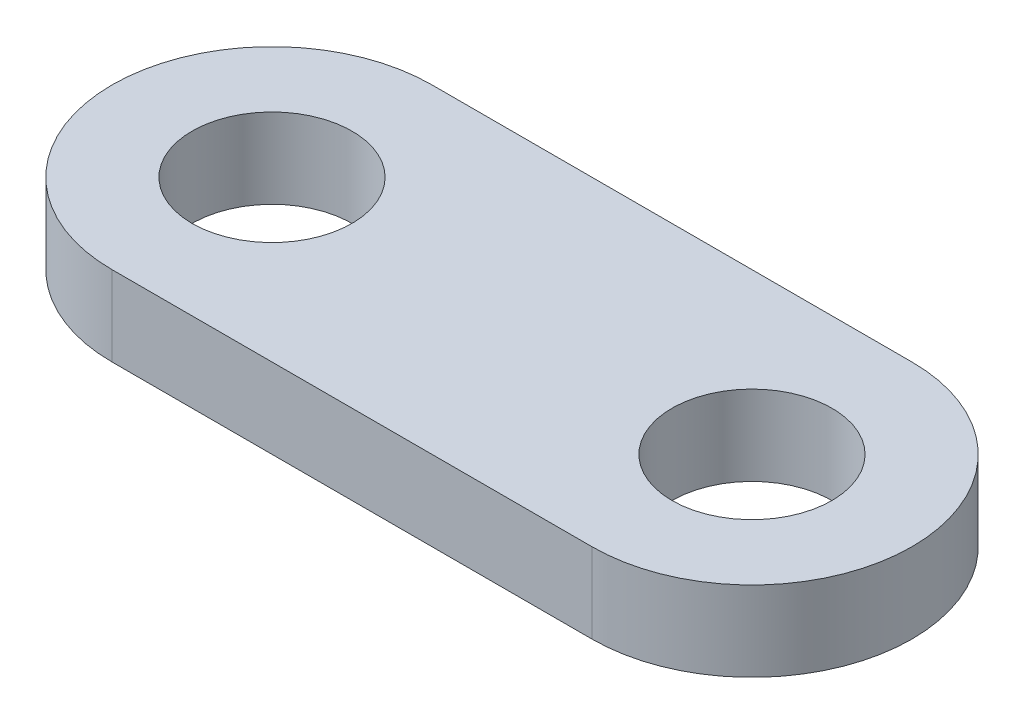
ISO-10303-21;
HEADER;
FILE_DESCRIPTION(('STEP AP214'),'2;1');
FILE_NAME('part.step','',(''),(''),'','','');
FILE_SCHEMA(('AUTOMOTIVE_DESIGN { 1 0 10303 214 1 1 1 1 }'));
ENDSEC;
DATA;
#1=APPLICATION_CONTEXT('core data for automotive mechanical design processes');
#2=APPLICATION_PROTOCOL_DEFINITION('international standard','automotive_design',2000,#1);
#3=PRODUCT_CONTEXT('',#1,'mechanical');
#4=PRODUCT('Part','Part','',(#3));
#5=PRODUCT_RELATED_PRODUCT_CATEGORY('part','',(#4));
#6=PRODUCT_DEFINITION_FORMATION('','',#4);
#7=PRODUCT_DEFINITION_CONTEXT('part definition',#1,'design');
#8=PRODUCT_DEFINITION('design','',#6,#7);
#9=PRODUCT_DEFINITION_SHAPE('','',#8);
#10=(LENGTH_UNIT() NAMED_UNIT(*) SI_UNIT(.MILLI.,.METRE.));
#11=(NAMED_UNIT(*) PLANE_ANGLE_UNIT() SI_UNIT($,.RADIAN.));
#12=(NAMED_UNIT(*) SI_UNIT($,.STERADIAN.) SOLID_ANGLE_UNIT());
#13=UNCERTAINTY_MEASURE_WITH_UNIT(LENGTH_MEASURE(1.E-05),#10,'distance_accuracy_value','');
#14=(GEOMETRIC_REPRESENTATION_CONTEXT(3) GLOBAL_UNCERTAINTY_ASSIGNED_CONTEXT((#13)) GLOBAL_UNIT_ASSIGNED_CONTEXT((#10,
#11,#12)) REPRESENTATION_CONTEXT('',''));
#15=CARTESIAN_POINT('',(0.,0.,0.));
#16=DIRECTION('',(0.,0.,1.));
#17=DIRECTION('',(1.,0.,0.));
#18=AXIS2_PLACEMENT_3D('',#15,#16,#17);
#19=CARTESIAN_POINT('',(0.,5.,0.));
#20=DIRECTION('',(0.,1.,0.));
#21=DIRECTION('',(0.,0.,1.));
#22=AXIS2_PLACEMENT_3D('',#19,#20,#21);
#23=PLANE('',#22);
#24=CARTESIAN_POINT('',(0.,5.,0.));
#25=DIRECTION('',(0.,1.,0.));
#26=DIRECTION('',(0.,0.,1.));
#27=AXIS2_PLACEMENT_3D('',#24,#25,#26);
#28=CIRCLE('',#27,5.);
#29=CARTESIAN_POINT('',(0.,5.,5.));
#30=VERTEX_POINT('',#29);
#31=EDGE_CURVE('E115',#30,#30,#28,.T.);
#32=ORIENTED_EDGE('',*,*,#31,.F.);
#33=EDGE_LOOP('',(#32));
#34=FACE_BOUND('',#33,.T.);
#35=CARTESIAN_POINT('',(0.,5.,0.));
#36=DIRECTION('',(0.,1.,0.));
#37=DIRECTION('',(0.,0.,1.));
#38=AXIS2_PLACEMENT_3D('',#35,#36,#37);
#39=CIRCLE('',#38,10.);
#40=CARTESIAN_POINT('',(0.,5.,-9.99999999999999));
#41=VERTEX_POINT('',#40);
#42=CARTESIAN_POINT('',(0.,5.,9.99999999999999));
#43=VERTEX_POINT('',#42);
#44=EDGE_CURVE('E93',#41,#43,#39,.T.);
#45=ORIENTED_EDGE('',*,*,#44,.T.);
#46=DIRECTION('',(1.,0.,0.));
#47=VECTOR('',#46,1.);
#48=CARTESIAN_POINT('',(0.,5.,9.99999999999999));
#49=LINE('',#48,#47);
#50=CARTESIAN_POINT('',(30.,5.,9.99999999999999));
#51=VERTEX_POINT('',#50);
#52=EDGE_CURVE('E88',#43,#51,#49,.T.);
#53=ORIENTED_EDGE('',*,*,#52,.T.);
#54=CARTESIAN_POINT('',(30.,5.,0.));
#55=DIRECTION('',(0.,1.,0.));
#56=DIRECTION('',(0.,0.,1.));
#57=AXIS2_PLACEMENT_3D('',#54,#55,#56);
#58=CIRCLE('',#57,10.);
#59=CARTESIAN_POINT('',(30.,5.,-9.99999999999999));
#60=VERTEX_POINT('',#59);
#61=EDGE_CURVE('E91',#51,#60,#58,.T.);
#62=ORIENTED_EDGE('',*,*,#61,.T.);
#63=DIRECTION('',(-1.,0.,0.));
#64=VECTOR('',#63,1.);
#65=CARTESIAN_POINT('',(0.,5.,-9.99999999999999));
#66=LINE('',#65,#64);
#67=EDGE_CURVE('E58',#60,#41,#66,.T.);
#68=ORIENTED_EDGE('',*,*,#67,.T.);
#69=EDGE_LOOP('',(#45,#53,#62,#68));
#70=FACE_BOUND('',#69,.T.);
#71=CARTESIAN_POINT('',(30.,5.,0.));
#72=DIRECTION('',(0.,1.,0.));
#73=DIRECTION('',(0.,0.,1.));
#74=AXIS2_PLACEMENT_3D('',#71,#72,#73);
#75=CIRCLE('',#74,5.);
#76=CARTESIAN_POINT('',(30.,5.,5.));
#77=VERTEX_POINT('',#76);
#78=EDGE_CURVE('E141',#77,#77,#75,.T.);
#79=ORIENTED_EDGE('',*,*,#78,.F.);
#80=EDGE_LOOP('',(#79));
#81=FACE_BOUND('',#80,.T.);
#82=ADVANCED_FACE('F40',(#34,#70,#81),#23,.T.);
#83=CARTESIAN_POINT('',(0.,0.,0.));
#84=DIRECTION('',(0.,1.,0.));
#85=DIRECTION('',(0.,0.,1.));
#86=AXIS2_PLACEMENT_3D('',#83,#84,#85);
#87=PLANE('',#86);
#88=CARTESIAN_POINT('',(0.,0.,0.));
#89=DIRECTION('',(0.,1.,0.));
#90=DIRECTION('',(0.,0.,1.));
#91=AXIS2_PLACEMENT_3D('',#88,#89,#90);
#92=CIRCLE('',#91,10.);
#93=CARTESIAN_POINT('',(0.,0.,-9.99999999999999));
#94=VERTEX_POINT('',#93);
#95=CARTESIAN_POINT('',(0.,0.,9.99999999999999));
#96=VERTEX_POINT('',#95);
#97=EDGE_CURVE('E111',#94,#96,#92,.T.);
#98=ORIENTED_EDGE('',*,*,#97,.F.);
#99=DIRECTION('',(-1.,0.,0.));
#100=VECTOR('',#99,1.);
#101=CARTESIAN_POINT('',(0.,0.,-9.99999999999999));
#102=LINE('',#101,#100);
#103=CARTESIAN_POINT('',(30.,0.,-9.99999999999999));
#104=VERTEX_POINT('',#103);
#105=EDGE_CURVE('E81',#104,#94,#102,.T.);
#106=ORIENTED_EDGE('',*,*,#105,.F.);
#107=CARTESIAN_POINT('',(30.,0.,0.));
#108=DIRECTION('',(0.,1.,0.));
#109=DIRECTION('',(0.,0.,1.));
#110=AXIS2_PLACEMENT_3D('',#107,#108,#109);
#111=CIRCLE('',#110,10.);
#112=CARTESIAN_POINT('',(30.,0.,9.99999999999999));
#113=VERTEX_POINT('',#112);
#114=EDGE_CURVE('E75',#113,#104,#111,.T.);
#115=ORIENTED_EDGE('',*,*,#114,.F.);
#116=DIRECTION('',(1.,0.,0.));
#117=VECTOR('',#116,1.);
#118=CARTESIAN_POINT('',(0.,0.,9.99999999999999));
#119=LINE('',#118,#117);
#120=EDGE_CURVE('E98',#96,#113,#119,.T.);
#121=ORIENTED_EDGE('',*,*,#120,.F.);
#122=EDGE_LOOP('',(#98,#106,#115,#121));
#123=FACE_BOUND('',#122,.T.);
#124=CARTESIAN_POINT('',(0.,0.,0.));
#125=DIRECTION('',(0.,1.,0.));
#126=DIRECTION('',(0.,0.,1.));
#127=AXIS2_PLACEMENT_3D('',#124,#125,#126);
#128=CIRCLE('',#127,5.);
#129=CARTESIAN_POINT('',(0.,0.,5.));
#130=VERTEX_POINT('',#129);
#131=EDGE_CURVE('E137',#130,#130,#128,.T.);
#132=ORIENTED_EDGE('',*,*,#131,.T.);
#133=EDGE_LOOP('',(#132));
#134=FACE_BOUND('',#133,.T.);
#135=CARTESIAN_POINT('',(30.,0.,0.));
#136=DIRECTION('',(0.,1.,0.));
#137=DIRECTION('',(0.,0.,1.));
#138=AXIS2_PLACEMENT_3D('',#135,#136,#137);
#139=CIRCLE('',#138,5.);
#140=CARTESIAN_POINT('',(30.,0.,5.));
#141=VERTEX_POINT('',#140);
#142=EDGE_CURVE('E145',#141,#141,#139,.T.);
#143=ORIENTED_EDGE('',*,*,#142,.T.);
#144=EDGE_LOOP('',(#143));
#145=FACE_BOUND('',#144,.T.);
#146=ADVANCED_FACE('F130',(#123,#134,#145),#87,.F.);
#147=CARTESIAN_POINT('',(0.,5.,0.));
#148=DIRECTION('',(0.,-1.,0.));
#149=DIRECTION('',(0.,0.,-1.));
#150=AXIS2_PLACEMENT_3D('',#147,#148,#149);
#151=CYLINDRICAL_SURFACE('',#150,10.);
#152=ORIENTED_EDGE('',*,*,#97,.T.);
#153=DIRECTION('',(0.,-1.,0.));
#154=VECTOR('',#153,1.);
#155=CARTESIAN_POINT('',(0.,5.,9.99999999999999));
#156=LINE('',#155,#154);
#157=EDGE_CURVE('E11',#43,#96,#156,.T.);
#158=ORIENTED_EDGE('',*,*,#157,.F.);
#159=ORIENTED_EDGE('',*,*,#44,.F.);
#160=DIRECTION('',(0.,-1.,0.));
#161=VECTOR('',#160,1.);
#162=CARTESIAN_POINT('',(0.,5.,-9.99999999999999));
#163=LINE('',#162,#161);
#164=EDGE_CURVE('E107',#41,#94,#163,.T.);
#165=ORIENTED_EDGE('',*,*,#164,.T.);
#166=EDGE_LOOP('',(#152,#158,#159,#165));
#167=FACE_BOUND('',#166,.T.);
#168=ADVANCED_FACE('F42',(#167),#151,.T.);
#169=CARTESIAN_POINT('',(0.,5.,9.99999999999999));
#170=DIRECTION('',(0.,0.,-1.));
#171=DIRECTION('',(-1.,0.,0.));
#172=AXIS2_PLACEMENT_3D('',#169,#170,#171);
#173=PLANE('',#172);
#174=ORIENTED_EDGE('',*,*,#120,.T.);
#175=DIRECTION('',(0.,-1.,0.));
#176=VECTOR('',#175,1.);
#177=CARTESIAN_POINT('',(30.,5.,9.99999999999999));
#178=LINE('',#177,#176);
#179=EDGE_CURVE('E50',#51,#113,#178,.T.);
#180=ORIENTED_EDGE('',*,*,#179,.F.);
#181=ORIENTED_EDGE('',*,*,#52,.F.);
#182=ORIENTED_EDGE('',*,*,#157,.T.);
#183=EDGE_LOOP('',(#174,#180,#181,#182));
#184=FACE_BOUND('',#183,.T.);
#185=ADVANCED_FACE('F97',(#184),#173,.F.);
#186=CARTESIAN_POINT('',(30.,5.,0.));
#187=DIRECTION('',(0.,-1.,0.));
#188=DIRECTION('',(0.,0.,-1.));
#189=AXIS2_PLACEMENT_3D('',#186,#187,#188);
#190=CYLINDRICAL_SURFACE('',#189,10.);
#191=ORIENTED_EDGE('',*,*,#114,.T.);
#192=DIRECTION('',(0.,-1.,0.));
#193=VECTOR('',#192,1.);
#194=CARTESIAN_POINT('',(30.,5.,-9.99999999999999));
#195=LINE('',#194,#193);
#196=EDGE_CURVE('E100',#60,#104,#195,.T.);
#197=ORIENTED_EDGE('',*,*,#196,.F.);
#198=ORIENTED_EDGE('',*,*,#61,.F.);
#199=ORIENTED_EDGE('',*,*,#179,.T.);
#200=EDGE_LOOP('',(#191,#197,#198,#199));
#201=FACE_BOUND('',#200,.T.);
#202=ADVANCED_FACE('F101',(#201),#190,.T.);
#203=CARTESIAN_POINT('',(0.,5.,-9.99999999999999));
#204=DIRECTION('',(0.,0.,1.));
#205=DIRECTION('',(1.,0.,0.));
#206=AXIS2_PLACEMENT_3D('',#203,#204,#205);
#207=PLANE('',#206);
#208=ORIENTED_EDGE('',*,*,#105,.T.);
#209=ORIENTED_EDGE('',*,*,#164,.F.);
#210=ORIENTED_EDGE('',*,*,#67,.F.);
#211=ORIENTED_EDGE('',*,*,#196,.T.);
#212=EDGE_LOOP('',(#208,#209,#210,#211));
#213=FACE_BOUND('',#212,.T.);
#214=ADVANCED_FACE('F127',(#213),#207,.F.);
#215=CARTESIAN_POINT('',(0.,5.,0.));
#216=DIRECTION('',(0.,-1.,0.));
#217=DIRECTION('',(0.,0.,-1.));
#218=AXIS2_PLACEMENT_3D('',#215,#216,#217);
#219=CYLINDRICAL_SURFACE('',#218,5.);
#220=ORIENTED_EDGE('',*,*,#31,.T.);
#221=EDGE_LOOP('',(#220));
#222=FACE_BOUND('',#221,.T.);
#223=ORIENTED_EDGE('',*,*,#131,.F.);
#224=EDGE_LOOP('',(#223));
#225=FACE_BOUND('',#224,.T.);
#226=ADVANCED_FACE('F166',(#222,#225),#219,.F.);
#227=CARTESIAN_POINT('',(30.,5.,0.));
#228=DIRECTION('',(0.,-1.,0.));
#229=DIRECTION('',(0.,0.,-1.));
#230=AXIS2_PLACEMENT_3D('',#227,#228,#229);
#231=CYLINDRICAL_SURFACE('',#230,5.);
#232=ORIENTED_EDGE('',*,*,#78,.T.);
#233=EDGE_LOOP('',(#232));
#234=FACE_BOUND('',#233,.T.);
#235=ORIENTED_EDGE('',*,*,#142,.F.);
#236=EDGE_LOOP('',(#235));
#237=FACE_BOUND('',#236,.T.);
#238=ADVANCED_FACE('F155',(#234,#237),#231,.F.);
#239=CLOSED_SHELL('',(#82,#146,#168,#185,#202,#214,#226,#238));
#240=MANIFOLD_SOLID_BREP('B2',#239);
#241=ADVANCED_BREP_SHAPE_REPRESENTATION('',(#18,#240),#14);
#242=SHAPE_DEFINITION_REPRESENTATION(#9,#241);
ENDSEC;
END-ISO-10303-21;
